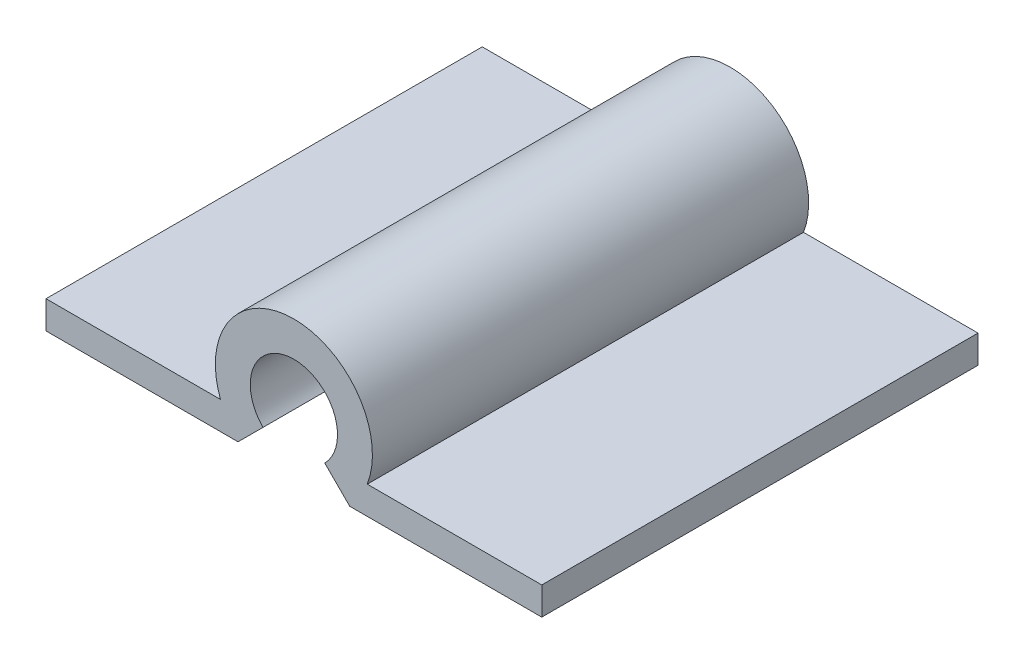
ISO-10303-21;
HEADER;
FILE_DESCRIPTION(('STEP AP214'),'2;1');
FILE_NAME('part.step','',(''),(''),'','','');
FILE_SCHEMA(('AUTOMOTIVE_DESIGN { 1 0 10303 214 1 1 1 1 }'));
ENDSEC;
DATA;
#1=APPLICATION_CONTEXT('core data for automotive mechanical design processes');
#2=APPLICATION_PROTOCOL_DEFINITION('international standard','automotive_design',2000,#1);
#3=PRODUCT_CONTEXT('',#1,'mechanical');
#4=PRODUCT('Part','Part','',(#3));
#5=PRODUCT_RELATED_PRODUCT_CATEGORY('part','',(#4));
#6=PRODUCT_DEFINITION_FORMATION('','',#4);
#7=PRODUCT_DEFINITION_CONTEXT('part definition',#1,'design');
#8=PRODUCT_DEFINITION('design','',#6,#7);
#9=PRODUCT_DEFINITION_SHAPE('','',#8);
#10=(LENGTH_UNIT() NAMED_UNIT(*) SI_UNIT(.MILLI.,.METRE.));
#11=(NAMED_UNIT(*) PLANE_ANGLE_UNIT() SI_UNIT($,.RADIAN.));
#12=(NAMED_UNIT(*) SI_UNIT($,.STERADIAN.) SOLID_ANGLE_UNIT());
#13=UNCERTAINTY_MEASURE_WITH_UNIT(LENGTH_MEASURE(1.E-05),#10,'distance_accuracy_value','');
#14=(GEOMETRIC_REPRESENTATION_CONTEXT(3) GLOBAL_UNCERTAINTY_ASSIGNED_CONTEXT((#13)) GLOBAL_UNIT_ASSIGNED_CONTEXT((#10,
#11,#12)) REPRESENTATION_CONTEXT('',''));
#15=CARTESIAN_POINT('',(0.,0.,0.));
#16=DIRECTION('',(0.,0.,1.));
#17=DIRECTION('',(1.,0.,0.));
#18=AXIS2_PLACEMENT_3D('',#15,#16,#17);
#19=CARTESIAN_POINT('',(0.,0.,15.875));
#20=DIRECTION('',(0.,0.,-1.));
#21=DIRECTION('',(-1.,0.,0.));
#22=AXIS2_PLACEMENT_3D('',#19,#20,#21);
#23=CYLINDRICAL_SURFACE('',#22,2.8575);
#24=CARTESIAN_POINT('',(0.,0.,0.));
#25=DIRECTION('',(0.,0.,1.));
#26=DIRECTION('',(1.,0.,0.));
#27=AXIS2_PLACEMENT_3D('',#24,#25,#26);
#28=CIRCLE('',#27,2.8575);
#29=CARTESIAN_POINT('',(2.67077708729126,-1.016,0.));
#30=VERTEX_POINT('',#29);
#31=CARTESIAN_POINT('',(-2.67077708729126,-1.016,0.));
#32=VERTEX_POINT('',#31);
#33=EDGE_CURVE('E141',#30,#32,#28,.T.);
#34=ORIENTED_EDGE('',*,*,#33,.T.);
#35=DIRECTION('',(0.,0.,-1.));
#36=VECTOR('',#35,1.);
#37=CARTESIAN_POINT('',(-2.67077708729126,-1.016,15.875));
#38=LINE('',#37,#36);
#39=CARTESIAN_POINT('',(-2.67077708729126,-1.016,15.875));
#40=VERTEX_POINT('',#39);
#41=EDGE_CURVE('E11',#40,#32,#38,.T.);
#42=ORIENTED_EDGE('',*,*,#41,.F.);
#43=CARTESIAN_POINT('',(0.,0.,15.875));
#44=DIRECTION('',(0.,0.,1.));
#45=DIRECTION('',(1.,0.,0.));
#46=AXIS2_PLACEMENT_3D('',#43,#44,#45);
#47=CIRCLE('',#46,2.8575);
#48=CARTESIAN_POINT('',(2.67077708729126,-1.016,15.875));
#49=VERTEX_POINT('',#48);
#50=EDGE_CURVE('E164',#49,#40,#47,.T.);
#51=ORIENTED_EDGE('',*,*,#50,.F.);
#52=DIRECTION('',(0.,0.,-1.));
#53=VECTOR('',#52,1.);
#54=CARTESIAN_POINT('',(2.67077708729126,-1.016,15.875));
#55=LINE('',#54,#53);
#56=EDGE_CURVE('E48',#49,#30,#55,.T.);
#57=ORIENTED_EDGE('',*,*,#56,.T.);
#58=EDGE_LOOP('',(#34,#42,#51,#57));
#59=FACE_BOUND('',#58,.T.);
#60=ADVANCED_FACE('F32',(#59),#23,.T.);
#61=CARTESIAN_POINT('',(-2.67077708729126,-1.016,15.875));
#62=DIRECTION('',(0.,-1.,0.));
#63=DIRECTION('',(1.,0.,0.));
#64=AXIS2_PLACEMENT_3D('',#61,#62,#63);
#65=PLANE('',#64);
#66=DIRECTION('',(-1.,0.,0.));
#67=VECTOR('',#66,1.);
#68=CARTESIAN_POINT('',(-2.67077708729126,-1.016,0.));
#69=LINE('',#68,#67);
#70=CARTESIAN_POINT('',(-9.02077708729126,-1.016,0.));
#71=VERTEX_POINT('',#70);
#72=EDGE_CURVE('E143',#32,#71,#69,.T.);
#73=ORIENTED_EDGE('',*,*,#72,.T.);
#74=DIRECTION('',(0.,0.,-1.));
#75=VECTOR('',#74,1.);
#76=CARTESIAN_POINT('',(-9.02077708729126,-1.016,15.875));
#77=LINE('',#76,#75);
#78=CARTESIAN_POINT('',(-9.02077708729126,-1.016,15.875));
#79=VERTEX_POINT('',#78);
#80=EDGE_CURVE('E40',#79,#71,#77,.T.);
#81=ORIENTED_EDGE('',*,*,#80,.F.);
#82=DIRECTION('',(-1.,0.,0.));
#83=VECTOR('',#82,1.);
#84=CARTESIAN_POINT('',(-2.67077708729126,-1.016,15.875));
#85=LINE('',#84,#83);
#86=EDGE_CURVE('E92',#40,#79,#85,.T.);
#87=ORIENTED_EDGE('',*,*,#86,.F.);
#88=ORIENTED_EDGE('',*,*,#41,.T.);
#89=EDGE_LOOP('',(#73,#81,#87,#88));
#90=FACE_BOUND('',#89,.T.);
#91=ADVANCED_FACE('F219',(#90),#65,.F.);
#92=CARTESIAN_POINT('',(-9.02077708729126,-1.016,15.875));
#93=DIRECTION('',(1.,0.,0.));
#94=DIRECTION('',(0.,0.,-1.));
#95=AXIS2_PLACEMENT_3D('',#92,#93,#94);
#96=PLANE('',#95);
#97=DIRECTION('',(0.,-1.,0.));
#98=VECTOR('',#97,1.);
#99=CARTESIAN_POINT('',(-9.02077708729126,-1.016,0.));
#100=LINE('',#99,#98);
#101=CARTESIAN_POINT('',(-9.02077708729126,-2.032,0.));
#102=VERTEX_POINT('',#101);
#103=EDGE_CURVE('E145',#71,#102,#100,.T.);
#104=ORIENTED_EDGE('',*,*,#103,.T.);
#105=DIRECTION('',(0.,0.,-1.));
#106=VECTOR('',#105,1.);
#107=CARTESIAN_POINT('',(-9.02077708729126,-2.032,15.875));
#108=LINE('',#107,#106);
#109=CARTESIAN_POINT('',(-9.02077708729126,-2.032,15.875));
#110=VERTEX_POINT('',#109);
#111=EDGE_CURVE('E175',#110,#102,#108,.T.);
#112=ORIENTED_EDGE('',*,*,#111,.F.);
#113=DIRECTION('',(0.,-1.,0.));
#114=VECTOR('',#113,1.);
#115=CARTESIAN_POINT('',(-9.02077708729126,-1.016,15.875));
#116=LINE('',#115,#114);
#117=EDGE_CURVE('E183',#79,#110,#116,.T.);
#118=ORIENTED_EDGE('',*,*,#117,.F.);
#119=ORIENTED_EDGE('',*,*,#80,.T.);
#120=EDGE_LOOP('',(#104,#112,#118,#119));
#121=FACE_BOUND('',#120,.T.);
#122=ADVANCED_FACE('F181',(#121),#96,.F.);
#123=CARTESIAN_POINT('',(-9.02077708729126,-2.032,15.875));
#124=DIRECTION('',(0.,1.,0.));
#125=DIRECTION('',(-1.,0.,0.));
#126=AXIS2_PLACEMENT_3D('',#123,#124,#125);
#127=PLANE('',#126);
#128=DIRECTION('',(1.,0.,0.));
#129=VECTOR('',#128,1.);
#130=CARTESIAN_POINT('',(-9.02077708729126,-2.032,0.));
#131=LINE('',#130,#129);
#132=CARTESIAN_POINT('',(-2.03199999999999,-2.032,0.));
#133=VERTEX_POINT('',#132);
#134=EDGE_CURVE('E147',#102,#133,#131,.T.);
#135=ORIENTED_EDGE('',*,*,#134,.T.);
#136=DIRECTION('',(0.,0.,-1.));
#137=VECTOR('',#136,1.);
#138=CARTESIAN_POINT('',(-2.03199999999999,-2.032,15.875));
#139=LINE('',#138,#137);
#140=CARTESIAN_POINT('',(-2.03199999999999,-2.032,15.875));
#141=VERTEX_POINT('',#140);
#142=EDGE_CURVE('E172',#141,#133,#139,.T.);
#143=ORIENTED_EDGE('',*,*,#142,.F.);
#144=DIRECTION('',(1.,0.,0.));
#145=VECTOR('',#144,1.);
#146=CARTESIAN_POINT('',(-9.02077708729126,-2.032,15.875));
#147=LINE('',#146,#145);
#148=EDGE_CURVE('E199',#110,#141,#147,.T.);
#149=ORIENTED_EDGE('',*,*,#148,.F.);
#150=ORIENTED_EDGE('',*,*,#111,.T.);
#151=EDGE_LOOP('',(#135,#143,#149,#150));
#152=FACE_BOUND('',#151,.T.);
#153=ADVANCED_FACE('F190',(#152),#127,.F.);
#154=CARTESIAN_POINT('',(-2.03199999999999,-2.032,15.875));
#155=DIRECTION('',(-0.70710678118655,0.707106781186545,0.));
#156=DIRECTION('',(-0.707106781186545,-0.70710678118655,0.));
#157=AXIS2_PLACEMENT_3D('',#154,#155,#156);
#158=PLANE('',#157);
#159=DIRECTION('',(0.707106781186545,0.707106781186549,0.));
#160=VECTOR('',#159,1.);
#161=CARTESIAN_POINT('',(-2.03199999999999,-2.032,0.));
#162=LINE('',#161,#160);
#163=CARTESIAN_POINT('',(-1.12253201513364,-1.12253201513365,0.));
#164=VERTEX_POINT('',#163);
#165=EDGE_CURVE('E149',#133,#164,#162,.T.);
#166=ORIENTED_EDGE('',*,*,#165,.T.);
#167=DIRECTION('',(0.,0.,-1.));
#168=VECTOR('',#167,1.);
#169=CARTESIAN_POINT('',(-1.12253201513364,-1.12253201513365,15.875));
#170=LINE('',#169,#168);
#171=CARTESIAN_POINT('',(-1.12253201513364,-1.12253201513365,15.875));
#172=VERTEX_POINT('',#171);
#173=EDGE_CURVE('E170',#172,#164,#170,.T.);
#174=ORIENTED_EDGE('',*,*,#173,.F.);
#175=DIRECTION('',(0.707106781186545,0.707106781186549,0.));
#176=VECTOR('',#175,1.);
#177=CARTESIAN_POINT('',(-2.03199999999999,-2.032,15.875));
#178=LINE('',#177,#176);
#179=EDGE_CURVE('E196',#141,#172,#178,.T.);
#180=ORIENTED_EDGE('',*,*,#179,.F.);
#181=ORIENTED_EDGE('',*,*,#142,.T.);
#182=EDGE_LOOP('',(#166,#174,#180,#181));
#183=FACE_BOUND('',#182,.T.);
#184=ADVANCED_FACE('F194',(#183),#158,.F.);
#185=CARTESIAN_POINT('',(0.,0.,15.875));
#186=DIRECTION('',(0.,0.,-1.));
#187=DIRECTION('',(-1.,0.,0.));
#188=AXIS2_PLACEMENT_3D('',#185,#186,#187);
#189=CYLINDRICAL_SURFACE('',#188,1.5875);
#190=CARTESIAN_POINT('',(0.,0.,0.));
#191=DIRECTION('',(0.,0.,1.));
#192=DIRECTION('',(1.,0.,0.));
#193=AXIS2_PLACEMENT_3D('',#190,#191,#192);
#194=CIRCLE('',#193,1.5875);
#195=CARTESIAN_POINT('',(1.12253201513365,-1.12253201513364,0.));
#196=VERTEX_POINT('',#195);
#197=EDGE_CURVE('E152',#196,#164,#194,.T.);
#198=ORIENTED_EDGE('',*,*,#197,.F.);
#199=DIRECTION('',(0.,0.,-1.));
#200=VECTOR('',#199,1.);
#201=CARTESIAN_POINT('',(1.12253201513365,-1.12253201513364,15.875));
#202=LINE('',#201,#200);
#203=CARTESIAN_POINT('',(1.12253201513365,-1.12253201513364,15.875));
#204=VERTEX_POINT('',#203);
#205=EDGE_CURVE('E168',#204,#196,#202,.T.);
#206=ORIENTED_EDGE('',*,*,#205,.F.);
#207=CARTESIAN_POINT('',(0.,0.,15.875));
#208=DIRECTION('',(0.,0.,1.));
#209=DIRECTION('',(1.,0.,0.));
#210=AXIS2_PLACEMENT_3D('',#207,#208,#209);
#211=CIRCLE('',#210,1.5875);
#212=EDGE_CURVE('E198',#204,#172,#211,.T.);
#213=ORIENTED_EDGE('',*,*,#212,.T.);
#214=ORIENTED_EDGE('',*,*,#173,.T.);
#215=EDGE_LOOP('',(#198,#206,#213,#214));
#216=FACE_BOUND('',#215,.T.);
#217=ADVANCED_FACE('F235',(#216),#189,.F.);
#218=CARTESIAN_POINT('',(2.03200000000002,-2.032,15.875));
#219=DIRECTION('',(-0.707106781186544,-0.707106781186551,0.));
#220=DIRECTION('',(0.707106781186551,-0.707106781186544,0.));
#221=AXIS2_PLACEMENT_3D('',#218,#219,#220);
#222=PLANE('',#221);
#223=DIRECTION('',(-0.707106781186551,0.707106781186544,0.));
#224=VECTOR('',#223,1.);
#225=CARTESIAN_POINT('',(2.03200000000002,-2.032,0.));
#226=LINE('',#225,#224);
#227=CARTESIAN_POINT('',(2.03200000000002,-2.032,0.));
#228=VERTEX_POINT('',#227);
#229=EDGE_CURVE('E155',#228,#196,#226,.T.);
#230=ORIENTED_EDGE('',*,*,#229,.F.);
#231=DIRECTION('',(0.,0.,-1.));
#232=VECTOR('',#231,1.);
#233=CARTESIAN_POINT('',(2.03200000000002,-2.032,15.875));
#234=LINE('',#233,#232);
#235=CARTESIAN_POINT('',(2.03200000000002,-2.032,15.875));
#236=VERTEX_POINT('',#235);
#237=EDGE_CURVE('E133',#236,#228,#234,.T.);
#238=ORIENTED_EDGE('',*,*,#237,.F.);
#239=DIRECTION('',(-0.707106781186551,0.707106781186544,0.));
#240=VECTOR('',#239,1.);
#241=CARTESIAN_POINT('',(2.03200000000002,-2.032,15.875));
#242=LINE('',#241,#240);
#243=EDGE_CURVE('E123',#236,#204,#242,.T.);
#244=ORIENTED_EDGE('',*,*,#243,.T.);
#245=ORIENTED_EDGE('',*,*,#205,.T.);
#246=EDGE_LOOP('',(#230,#238,#244,#245));
#247=FACE_BOUND('',#246,.T.);
#248=ADVANCED_FACE('F206',(#247),#222,.T.);
#249=CARTESIAN_POINT('',(2.03200000000002,-2.032,15.875));
#250=DIRECTION('',(0.,1.,0.));
#251=DIRECTION('',(-1.,0.,0.));
#252=AXIS2_PLACEMENT_3D('',#249,#250,#251);
#253=PLANE('',#252);
#254=DIRECTION('',(1.,0.,0.));
#255=VECTOR('',#254,1.);
#256=CARTESIAN_POINT('',(2.03200000000002,-2.032,0.));
#257=LINE('',#256,#255);
#258=CARTESIAN_POINT('',(9.02077708729129,-2.032,0.));
#259=VERTEX_POINT('',#258);
#260=EDGE_CURVE('E130',#228,#259,#257,.T.);
#261=ORIENTED_EDGE('',*,*,#260,.T.);
#262=DIRECTION('',(0.,0.,-1.));
#263=VECTOR('',#262,1.);
#264=CARTESIAN_POINT('',(9.02077708729129,-2.032,15.875));
#265=LINE('',#264,#263);
#266=CARTESIAN_POINT('',(9.02077708729129,-2.032,15.875));
#267=VERTEX_POINT('',#266);
#268=EDGE_CURVE('E127',#267,#259,#265,.T.);
#269=ORIENTED_EDGE('',*,*,#268,.F.);
#270=DIRECTION('',(1.,0.,0.));
#271=VECTOR('',#270,1.);
#272=CARTESIAN_POINT('',(2.03200000000002,-2.032,15.875));
#273=LINE('',#272,#271);
#274=EDGE_CURVE('E115',#236,#267,#273,.T.);
#275=ORIENTED_EDGE('',*,*,#274,.F.);
#276=ORIENTED_EDGE('',*,*,#237,.T.);
#277=EDGE_LOOP('',(#261,#269,#275,#276));
#278=FACE_BOUND('',#277,.T.);
#279=ADVANCED_FACE('F128',(#278),#253,.F.);
#280=CARTESIAN_POINT('',(9.02077708729126,-1.016,15.875));
#281=DIRECTION('',(1.,0.,0.));
#282=DIRECTION('',(0.,1.,0.));
#283=AXIS2_PLACEMENT_3D('',#280,#281,#282);
#284=PLANE('',#283);
#285=DIRECTION('',(0.,-1.,0.));
#286=VECTOR('',#285,1.);
#287=CARTESIAN_POINT('',(9.02077708729126,-1.016,0.));
#288=LINE('',#287,#286);
#289=CARTESIAN_POINT('',(9.02077708729126,-1.016,0.));
#290=VERTEX_POINT('',#289);
#291=EDGE_CURVE('E159',#290,#259,#288,.T.);
#292=ORIENTED_EDGE('',*,*,#291,.F.);
#293=DIRECTION('',(0.,0.,-1.));
#294=VECTOR('',#293,1.);
#295=CARTESIAN_POINT('',(9.02077708729126,-1.016,15.875));
#296=LINE('',#295,#294);
#297=CARTESIAN_POINT('',(9.02077708729126,-1.016,15.875));
#298=VERTEX_POINT('',#297);
#299=EDGE_CURVE('E80',#298,#290,#296,.T.);
#300=ORIENTED_EDGE('',*,*,#299,.F.);
#301=DIRECTION('',(0.,-1.,0.));
#302=VECTOR('',#301,1.);
#303=CARTESIAN_POINT('',(9.02077708729126,-1.016,15.875));
#304=LINE('',#303,#302);
#305=EDGE_CURVE('E120',#298,#267,#304,.T.);
#306=ORIENTED_EDGE('',*,*,#305,.T.);
#307=ORIENTED_EDGE('',*,*,#268,.T.);
#308=EDGE_LOOP('',(#292,#300,#306,#307));
#309=FACE_BOUND('',#308,.T.);
#310=ADVANCED_FACE('F135',(#309),#284,.T.);
#311=CARTESIAN_POINT('',(2.67077708729126,-1.016,15.875));
#312=DIRECTION('',(0.,1.,0.));
#313=DIRECTION('',(-1.,0.,0.));
#314=AXIS2_PLACEMENT_3D('',#311,#312,#313);
#315=PLANE('',#314);
#316=DIRECTION('',(1.,0.,0.));
#317=VECTOR('',#316,1.);
#318=CARTESIAN_POINT('',(2.67077708729126,-1.016,0.));
#319=LINE('',#318,#317);
#320=EDGE_CURVE('E161',#30,#290,#319,.T.);
#321=ORIENTED_EDGE('',*,*,#320,.F.);
#322=ORIENTED_EDGE('',*,*,#56,.F.);
#323=DIRECTION('',(1.,0.,0.));
#324=VECTOR('',#323,1.);
#325=CARTESIAN_POINT('',(2.67077708729126,-1.016,15.875));
#326=LINE('',#325,#324);
#327=EDGE_CURVE('E136',#49,#298,#326,.T.);
#328=ORIENTED_EDGE('',*,*,#327,.T.);
#329=ORIENTED_EDGE('',*,*,#299,.T.);
#330=EDGE_LOOP('',(#321,#322,#328,#329));
#331=FACE_BOUND('',#330,.T.);
#332=ADVANCED_FACE('F208',(#331),#315,.T.);
#333=CARTESIAN_POINT('',(0.,0.,15.875));
#334=DIRECTION('',(0.,0.,1.));
#335=DIRECTION('',(1.,0.,0.));
#336=AXIS2_PLACEMENT_3D('',#333,#334,#335);
#337=PLANE('',#336);
#338=ORIENTED_EDGE('',*,*,#50,.T.);
#339=ORIENTED_EDGE('',*,*,#86,.T.);
#340=ORIENTED_EDGE('',*,*,#117,.T.);
#341=ORIENTED_EDGE('',*,*,#148,.T.);
#342=ORIENTED_EDGE('',*,*,#179,.T.);
#343=ORIENTED_EDGE('',*,*,#212,.F.);
#344=ORIENTED_EDGE('',*,*,#243,.F.);
#345=ORIENTED_EDGE('',*,*,#274,.T.);
#346=ORIENTED_EDGE('',*,*,#305,.F.);
#347=ORIENTED_EDGE('',*,*,#327,.F.);
#348=EDGE_LOOP('',(#338,#339,#340,#341,#342,#343,#344,#345,#346,#347));
#349=FACE_BOUND('',#348,.T.);
#350=ADVANCED_FACE('F117',(#349),#337,.T.);
#351=CARTESIAN_POINT('',(0.,0.,0.));
#352=DIRECTION('',(0.,0.,1.));
#353=DIRECTION('',(1.,0.,0.));
#354=AXIS2_PLACEMENT_3D('',#351,#352,#353);
#355=PLANE('',#354);
#356=ORIENTED_EDGE('',*,*,#33,.F.);
#357=ORIENTED_EDGE('',*,*,#320,.T.);
#358=ORIENTED_EDGE('',*,*,#291,.T.);
#359=ORIENTED_EDGE('',*,*,#260,.F.);
#360=ORIENTED_EDGE('',*,*,#229,.T.);
#361=ORIENTED_EDGE('',*,*,#197,.T.);
#362=ORIENTED_EDGE('',*,*,#165,.F.);
#363=ORIENTED_EDGE('',*,*,#134,.F.);
#364=ORIENTED_EDGE('',*,*,#103,.F.);
#365=ORIENTED_EDGE('',*,*,#72,.F.);
#366=EDGE_LOOP('',(#356,#357,#358,#359,#360,#361,#362,#363,#364,#365));
#367=FACE_BOUND('',#366,.T.);
#368=ADVANCED_FACE('F186',(#367),#355,.F.);
#369=CLOSED_SHELL('',(#60,#91,#122,#153,#184,#217,#248,#279,#310,#332,#350,#368));
#370=MANIFOLD_SOLID_BREP('B2',#369);
#371=ADVANCED_BREP_SHAPE_REPRESENTATION('',(#18,#370),#14);
#372=SHAPE_DEFINITION_REPRESENTATION(#9,#371);
ENDSEC;
END-ISO-10303-21;
